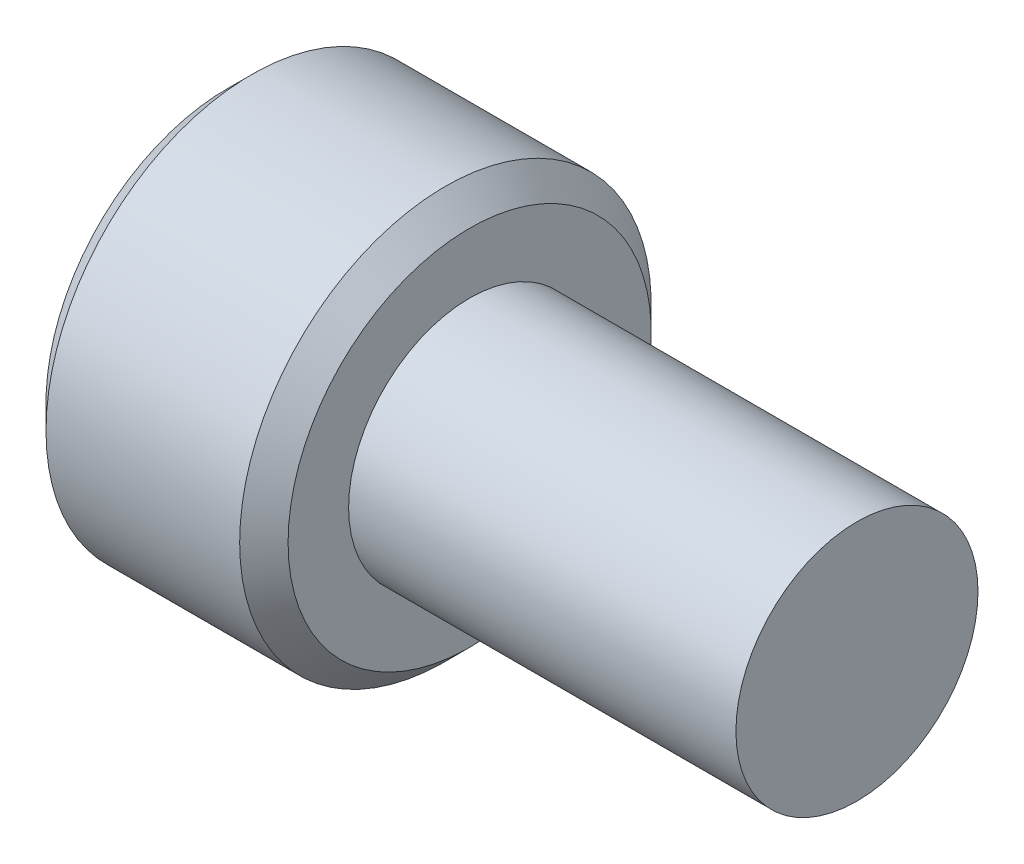
ISO-10303-21;
HEADER;
FILE_DESCRIPTION(('STEP AP214'),'2;1');
FILE_NAME('part.step','',(''),(''),'','','');
FILE_SCHEMA(('AUTOMOTIVE_DESIGN { 1 0 10303 214 1 1 1 1 }'));
ENDSEC;
DATA;
#1=APPLICATION_CONTEXT('core data for automotive mechanical design processes');
#2=APPLICATION_PROTOCOL_DEFINITION('international standard','automotive_design',2000,#1);
#3=PRODUCT_CONTEXT('',#1,'mechanical');
#4=PRODUCT('Part','Part','',(#3));
#5=PRODUCT_RELATED_PRODUCT_CATEGORY('part','',(#4));
#6=PRODUCT_DEFINITION_FORMATION('','',#4);
#7=PRODUCT_DEFINITION_CONTEXT('part definition',#1,'design');
#8=PRODUCT_DEFINITION('design','',#6,#7);
#9=PRODUCT_DEFINITION_SHAPE('','',#8);
#10=(LENGTH_UNIT() NAMED_UNIT(*) SI_UNIT(.MILLI.,.METRE.));
#11=(NAMED_UNIT(*) PLANE_ANGLE_UNIT() SI_UNIT($,.RADIAN.));
#12=(NAMED_UNIT(*) SI_UNIT($,.STERADIAN.) SOLID_ANGLE_UNIT());
#13=UNCERTAINTY_MEASURE_WITH_UNIT(LENGTH_MEASURE(1.E-05),#10,'distance_accuracy_value','');
#14=(GEOMETRIC_REPRESENTATION_CONTEXT(3) GLOBAL_UNCERTAINTY_ASSIGNED_CONTEXT((#13)) GLOBAL_UNIT_ASSIGNED_CONTEXT((#10,
#11,#12)) REPRESENTATION_CONTEXT('',''));
#15=CARTESIAN_POINT('',(0.,0.,0.));
#16=DIRECTION('',(0.,0.,1.));
#17=DIRECTION('',(1.,0.,0.));
#18=AXIS2_PLACEMENT_3D('',#15,#16,#17);
#19=CARTESIAN_POINT('',(-5.,0.,0.));
#20=DIRECTION('',(1.,0.,0.));
#21=DIRECTION('',(0.,0.,-1.));
#22=AXIS2_PLACEMENT_3D('',#19,#20,#21);
#23=PLANE('',#22);
#24=CARTESIAN_POINT('',(-5.,0.,0.));
#25=DIRECTION('',(1.,0.,0.));
#26=DIRECTION('',(0.,0.,-1.));
#27=AXIS2_PLACEMENT_3D('',#24,#25,#26);
#28=CIRCLE('',#27,3.75);
#29=CARTESIAN_POINT('',(-5.,0.,-3.75));
#30=VERTEX_POINT('',#29);
#31=EDGE_CURVE('E11',#30,#30,#28,.F.);
#32=ORIENTED_EDGE('',*,*,#31,.T.);
#33=EDGE_LOOP('',(#32));
#34=FACE_BOUND('',#33,.T.);
#35=DIRECTION('',(0.,0.5,-0.866025403784438));
#36=VECTOR('',#35,1.);
#37=CARTESIAN_POINT('',(-5.,1.15470053837925,2.));
#38=LINE('',#37,#36);
#39=CARTESIAN_POINT('',(-5.,1.15470053837925,2.));
#40=VERTEX_POINT('',#39);
#41=CARTESIAN_POINT('',(-5.,2.3094010767585,0.));
#42=VERTEX_POINT('',#41);
#43=EDGE_CURVE('E151',#40,#42,#38,.T.);
#44=ORIENTED_EDGE('',*,*,#43,.F.);
#45=DIRECTION('',(0.,1.,0.));
#46=VECTOR('',#45,1.);
#47=CARTESIAN_POINT('',(-5.,-1.15470053837925,2.));
#48=LINE('',#47,#46);
#49=CARTESIAN_POINT('',(-5.,-1.15470053837925,2.));
#50=VERTEX_POINT('',#49);
#51=EDGE_CURVE('E124',#50,#40,#48,.T.);
#52=ORIENTED_EDGE('',*,*,#51,.F.);
#53=DIRECTION('',(0.,0.5,0.866025403784439));
#54=VECTOR('',#53,1.);
#55=CARTESIAN_POINT('',(-5.,-2.3094010767585,0.));
#56=LINE('',#55,#54);
#57=CARTESIAN_POINT('',(-5.,-2.3094010767585,0.));
#58=VERTEX_POINT('',#57);
#59=EDGE_CURVE('E120',#58,#50,#56,.T.);
#60=ORIENTED_EDGE('',*,*,#59,.F.);
#61=DIRECTION('',(0.,-0.5,0.866025403784439));
#62=VECTOR('',#61,1.);
#63=CARTESIAN_POINT('',(-5.,-1.15470053837925,-2.));
#64=LINE('',#63,#62);
#65=CARTESIAN_POINT('',(-5.,-1.15470053837925,-2.));
#66=VERTEX_POINT('',#65);
#67=EDGE_CURVE('E157',#66,#58,#64,.T.);
#68=ORIENTED_EDGE('',*,*,#67,.F.);
#69=DIRECTION('',(0.,-1.,0.));
#70=VECTOR('',#69,1.);
#71=CARTESIAN_POINT('',(-5.,1.15470053837925,-2.));
#72=LINE('',#71,#70);
#73=CARTESIAN_POINT('',(-5.,1.15470053837925,-2.));
#74=VERTEX_POINT('',#73);
#75=EDGE_CURVE('E155',#74,#66,#72,.T.);
#76=ORIENTED_EDGE('',*,*,#75,.F.);
#77=DIRECTION('',(0.,-0.5,-0.866025403784439));
#78=VECTOR('',#77,1.);
#79=CARTESIAN_POINT('',(-5.,2.3094010767585,0.));
#80=LINE('',#79,#78);
#81=EDGE_CURVE('E153',#42,#74,#80,.T.);
#82=ORIENTED_EDGE('',*,*,#81,.F.);
#83=EDGE_LOOP('',(#44,#52,#60,#68,#76,#82));
#84=FACE_BOUND('',#83,.T.);
#85=ADVANCED_FACE('F38',(#34,#84),#23,.F.);
#86=CARTESIAN_POINT('',(0.,2.5,0.));
#87=DIRECTION('',(-1.,0.,0.));
#88=DIRECTION('',(0.,0.,1.));
#89=AXIS2_PLACEMENT_3D('',#86,#87,#88);
#90=PLANE('',#89);
#91=CARTESIAN_POINT('',(0.,0.,0.));
#92=DIRECTION('',(-1.,0.,0.));
#93=DIRECTION('',(0.,0.,1.));
#94=AXIS2_PLACEMENT_3D('',#91,#92,#93);
#95=CIRCLE('',#94,3.75);
#96=CARTESIAN_POINT('',(0.,0.,3.75));
#97=VERTEX_POINT('',#96);
#98=EDGE_CURVE('E46',#97,#97,#95,.F.);
#99=ORIENTED_EDGE('',*,*,#98,.T.);
#100=EDGE_LOOP('',(#99));
#101=FACE_BOUND('',#100,.T.);
#102=CARTESIAN_POINT('',(0.,0.,0.));
#103=DIRECTION('',(-1.,0.,0.));
#104=DIRECTION('',(0.,0.,1.));
#105=AXIS2_PLACEMENT_3D('',#102,#103,#104);
#106=CIRCLE('',#105,2.5);
#107=CARTESIAN_POINT('',(0.,0.,2.5));
#108=VERTEX_POINT('',#107);
#109=EDGE_CURVE('E176',#108,#108,#106,.T.);
#110=ORIENTED_EDGE('',*,*,#109,.T.);
#111=EDGE_LOOP('',(#110));
#112=FACE_BOUND('',#111,.T.);
#113=ADVANCED_FACE('F191',(#101,#112),#90,.F.);
#114=CARTESIAN_POINT('',(-10.4,0.,0.));
#115=DIRECTION('',(-1.,0.,0.));
#116=DIRECTION('',(0.,0.,1.));
#117=AXIS2_PLACEMENT_3D('',#114,#115,#116);
#118=CYLINDRICAL_SURFACE('',#117,4.25);
#119=CARTESIAN_POINT('',(-0.5,0.,0.));
#120=DIRECTION('',(-1.,0.,0.));
#121=DIRECTION('',(0.,0.,1.));
#122=AXIS2_PLACEMENT_3D('',#119,#120,#121);
#123=CIRCLE('',#122,4.25);
#124=CARTESIAN_POINT('',(-0.5,0.,4.25));
#125=VERTEX_POINT('',#124);
#126=EDGE_CURVE('E186',#125,#125,#123,.T.);
#127=ORIENTED_EDGE('',*,*,#126,.T.);
#128=EDGE_LOOP('',(#127));
#129=FACE_BOUND('',#128,.T.);
#130=CARTESIAN_POINT('',(-4.5,0.,0.));
#131=DIRECTION('',(1.,0.,0.));
#132=DIRECTION('',(0.,0.,-1.));
#133=AXIS2_PLACEMENT_3D('',#130,#131,#132);
#134=CIRCLE('',#133,4.25);
#135=CARTESIAN_POINT('',(-4.5,0.,-4.25));
#136=VERTEX_POINT('',#135);
#137=EDGE_CURVE('E183',#136,#136,#134,.T.);
#138=ORIENTED_EDGE('',*,*,#137,.T.);
#139=EDGE_LOOP('',(#138));
#140=FACE_BOUND('',#139,.T.);
#141=ADVANCED_FACE('F200',(#129,#140),#118,.T.);
#142=CARTESIAN_POINT('',(8.,2.5,0.));
#143=DIRECTION('',(-1.,0.,0.));
#144=DIRECTION('',(0.,0.,1.));
#145=AXIS2_PLACEMENT_3D('',#142,#143,#144);
#146=PLANE('',#145);
#147=CARTESIAN_POINT('',(8.,0.,0.));
#148=DIRECTION('',(-1.,0.,0.));
#149=DIRECTION('',(0.,0.,1.));
#150=AXIS2_PLACEMENT_3D('',#147,#148,#149);
#151=CIRCLE('',#150,2.5);
#152=CARTESIAN_POINT('',(8.,0.,2.5));
#153=VERTEX_POINT('',#152);
#154=EDGE_CURVE('E180',#153,#153,#151,.T.);
#155=ORIENTED_EDGE('',*,*,#154,.F.);
#156=EDGE_LOOP('',(#155));
#157=FACE_BOUND('',#156,.T.);
#158=ADVANCED_FACE('F203',(#157),#146,.F.);
#159=CARTESIAN_POINT('',(-10.4,0.,0.));
#160=DIRECTION('',(-1.,0.,0.));
#161=DIRECTION('',(0.,0.,1.));
#162=AXIS2_PLACEMENT_3D('',#159,#160,#161);
#163=CYLINDRICAL_SURFACE('',#162,2.5);
#164=ORIENTED_EDGE('',*,*,#109,.F.);
#165=EDGE_LOOP('',(#164));
#166=FACE_BOUND('',#165,.T.);
#167=ORIENTED_EDGE('',*,*,#154,.T.);
#168=EDGE_LOOP('',(#167));
#169=FACE_BOUND('',#168,.T.);
#170=ADVANCED_FACE('F276',(#166,#169),#163,.T.);
#171=CARTESIAN_POINT('',(-3.,-1.15470053837925,2.));
#172=DIRECTION('',(0.,0.,1.));
#173=DIRECTION('',(1.,0.,0.));
#174=AXIS2_PLACEMENT_3D('',#171,#172,#173);
#175=PLANE('',#174);
#176=DIRECTION('',(0.,1.,0.));
#177=VECTOR('',#176,1.);
#178=CARTESIAN_POINT('',(-3.,-1.15470053837925,2.));
#179=LINE('',#178,#177);
#180=CARTESIAN_POINT('',(-3.,-1.15470053837925,2.));
#181=VERTEX_POINT('',#180);
#182=CARTESIAN_POINT('',(-3.,0.,2.));
#183=VERTEX_POINT('',#182);
#184=EDGE_CURVE('E61',#181,#183,#179,.T.);
#185=ORIENTED_EDGE('',*,*,#184,.F.);
#186=DIRECTION('',(-1.,0.,0.));
#187=VECTOR('',#186,1.);
#188=CARTESIAN_POINT('',(-3.,-1.15470053837925,2.));
#189=LINE('',#188,#187);
#190=EDGE_CURVE('E161',#181,#50,#189,.T.);
#191=ORIENTED_EDGE('',*,*,#190,.T.);
#192=ORIENTED_EDGE('',*,*,#51,.T.);
#193=DIRECTION('',(-1.,0.,0.));
#194=VECTOR('',#193,1.);
#195=CARTESIAN_POINT('',(-3.,1.15470053837925,2.));
#196=LINE('',#195,#194);
#197=CARTESIAN_POINT('',(-3.,1.15470053837925,2.));
#198=VERTEX_POINT('',#197);
#199=EDGE_CURVE('E53',#198,#40,#196,.T.);
#200=ORIENTED_EDGE('',*,*,#199,.F.);
#201=EDGE_CURVE('E113',#183,#198,#179,.T.);
#202=ORIENTED_EDGE('',*,*,#201,.F.);
#203=EDGE_LOOP('',(#185,#191,#192,#200,#202));
#204=FACE_BOUND('',#203,.T.);
#205=ADVANCED_FACE('F122',(#204),#175,.F.);
#206=CARTESIAN_POINT('',(-3.,-2.3094010767585,0.));
#207=DIRECTION('',(0.,-0.866025403784439,0.5));
#208=DIRECTION('',(0.,-0.5,-0.866025403784439));
#209=AXIS2_PLACEMENT_3D('',#206,#207,#208);
#210=PLANE('',#209);
#211=DIRECTION('',(0.,0.5,0.866025403784439));
#212=VECTOR('',#211,1.);
#213=CARTESIAN_POINT('',(-3.,-2.3094010767585,0.));
#214=LINE('',#213,#212);
#215=CARTESIAN_POINT('',(-3.,-2.3094010767585,0.));
#216=VERTEX_POINT('',#215);
#217=CARTESIAN_POINT('',(-3.,-1.73205080756888,1.));
#218=VERTEX_POINT('',#217);
#219=EDGE_CURVE('E127',#216,#218,#214,.T.);
#220=ORIENTED_EDGE('',*,*,#219,.F.);
#221=DIRECTION('',(-1.,0.,0.));
#222=VECTOR('',#221,1.);
#223=CARTESIAN_POINT('',(-3.,-2.3094010767585,0.));
#224=LINE('',#223,#222);
#225=EDGE_CURVE('E164',#216,#58,#224,.T.);
#226=ORIENTED_EDGE('',*,*,#225,.T.);
#227=ORIENTED_EDGE('',*,*,#59,.T.);
#228=ORIENTED_EDGE('',*,*,#190,.F.);
#229=EDGE_CURVE('E147',#218,#181,#214,.T.);
#230=ORIENTED_EDGE('',*,*,#229,.F.);
#231=EDGE_LOOP('',(#220,#226,#227,#228,#230));
#232=FACE_BOUND('',#231,.T.);
#233=ADVANCED_FACE('F238',(#232),#210,.F.);
#234=CARTESIAN_POINT('',(-3.,-1.15470053837925,-2.));
#235=DIRECTION('',(0.,-0.866025403784439,-0.5));
#236=DIRECTION('',(0.,0.5,-0.866025403784439));
#237=AXIS2_PLACEMENT_3D('',#234,#235,#236);
#238=PLANE('',#237);
#239=DIRECTION('',(0.,-0.5,0.866025403784439));
#240=VECTOR('',#239,1.);
#241=CARTESIAN_POINT('',(-3.,-1.15470053837925,-2.));
#242=LINE('',#241,#240);
#243=CARTESIAN_POINT('',(-3.,-1.15470053837925,-2.));
#244=VERTEX_POINT('',#243);
#245=CARTESIAN_POINT('',(-3.,-1.73205080756888,-1.));
#246=VERTEX_POINT('',#245);
#247=EDGE_CURVE('E144',#244,#246,#242,.T.);
#248=ORIENTED_EDGE('',*,*,#247,.F.);
#249=DIRECTION('',(-1.,0.,0.));
#250=VECTOR('',#249,1.);
#251=CARTESIAN_POINT('',(-3.,-1.15470053837925,-2.));
#252=LINE('',#251,#250);
#253=EDGE_CURVE('E167',#244,#66,#252,.T.);
#254=ORIENTED_EDGE('',*,*,#253,.T.);
#255=ORIENTED_EDGE('',*,*,#67,.T.);
#256=ORIENTED_EDGE('',*,*,#225,.F.);
#257=EDGE_CURVE('E143',#246,#216,#242,.T.);
#258=ORIENTED_EDGE('',*,*,#257,.F.);
#259=EDGE_LOOP('',(#248,#254,#255,#256,#258));
#260=FACE_BOUND('',#259,.T.);
#261=ADVANCED_FACE('F245',(#260),#238,.F.);
#262=CARTESIAN_POINT('',(-3.,1.15470053837925,-2.));
#263=DIRECTION('',(0.,0.,-1.));
#264=DIRECTION('',(0.,1.,0.));
#265=AXIS2_PLACEMENT_3D('',#262,#263,#264);
#266=PLANE('',#265);
#267=DIRECTION('',(0.,-1.,0.));
#268=VECTOR('',#267,1.);
#269=CARTESIAN_POINT('',(-3.,1.15470053837925,-2.));
#270=LINE('',#269,#268);
#271=CARTESIAN_POINT('',(-3.,1.15470053837925,-2.));
#272=VERTEX_POINT('',#271);
#273=CARTESIAN_POINT('',(-3.,0.,-2.));
#274=VERTEX_POINT('',#273);
#275=EDGE_CURVE('E140',#272,#274,#270,.T.);
#276=ORIENTED_EDGE('',*,*,#275,.F.);
#277=DIRECTION('',(-1.,0.,0.));
#278=VECTOR('',#277,1.);
#279=CARTESIAN_POINT('',(-3.,1.15470053837925,-2.));
#280=LINE('',#279,#278);
#281=EDGE_CURVE('E170',#272,#74,#280,.T.);
#282=ORIENTED_EDGE('',*,*,#281,.T.);
#283=ORIENTED_EDGE('',*,*,#75,.T.);
#284=ORIENTED_EDGE('',*,*,#253,.F.);
#285=EDGE_CURVE('E139',#274,#244,#270,.T.);
#286=ORIENTED_EDGE('',*,*,#285,.F.);
#287=EDGE_LOOP('',(#276,#282,#283,#284,#286));
#288=FACE_BOUND('',#287,.T.);
#289=ADVANCED_FACE('F250',(#288),#266,.F.);
#290=CARTESIAN_POINT('',(-3.,2.3094010767585,0.));
#291=DIRECTION('',(0.,0.866025403784439,-0.5));
#292=DIRECTION('',(0.,0.5,0.866025403784439));
#293=AXIS2_PLACEMENT_3D('',#290,#291,#292);
#294=PLANE('',#293);
#295=DIRECTION('',(0.,-0.5,-0.866025403784439));
#296=VECTOR('',#295,1.);
#297=CARTESIAN_POINT('',(-3.,2.3094010767585,0.));
#298=LINE('',#297,#296);
#299=CARTESIAN_POINT('',(-3.,2.3094010767585,0.));
#300=VERTEX_POINT('',#299);
#301=CARTESIAN_POINT('',(-3.,1.73205080756888,-1.));
#302=VERTEX_POINT('',#301);
#303=EDGE_CURVE('E135',#300,#302,#298,.T.);
#304=ORIENTED_EDGE('',*,*,#303,.F.);
#305=DIRECTION('',(-1.,0.,0.));
#306=VECTOR('',#305,1.);
#307=CARTESIAN_POINT('',(-3.,2.3094010767585,0.));
#308=LINE('',#307,#306);
#309=EDGE_CURVE('E126',#300,#42,#308,.T.);
#310=ORIENTED_EDGE('',*,*,#309,.T.);
#311=ORIENTED_EDGE('',*,*,#81,.T.);
#312=ORIENTED_EDGE('',*,*,#281,.F.);
#313=EDGE_CURVE('E133',#302,#272,#298,.T.);
#314=ORIENTED_EDGE('',*,*,#313,.F.);
#315=EDGE_LOOP('',(#304,#310,#311,#312,#314));
#316=FACE_BOUND('',#315,.T.);
#317=ADVANCED_FACE('F219',(#316),#294,.F.);
#318=CARTESIAN_POINT('',(-3.,1.15470053837925,2.));
#319=DIRECTION('',(0.,0.866025403784439,0.5));
#320=DIRECTION('',(0.,-0.5,0.866025403784439));
#321=AXIS2_PLACEMENT_3D('',#318,#319,#320);
#322=PLANE('',#321);
#323=DIRECTION('',(0.,0.5,-0.866025403784438));
#324=VECTOR('',#323,1.);
#325=CARTESIAN_POINT('',(-3.,1.15470053837925,2.));
#326=LINE('',#325,#324);
#327=CARTESIAN_POINT('',(-3.,1.73205080756888,1.));
#328=VERTEX_POINT('',#327);
#329=EDGE_CURVE('E115',#198,#328,#326,.T.);
#330=ORIENTED_EDGE('',*,*,#329,.F.);
#331=ORIENTED_EDGE('',*,*,#199,.T.);
#332=ORIENTED_EDGE('',*,*,#43,.T.);
#333=ORIENTED_EDGE('',*,*,#309,.F.);
#334=EDGE_CURVE('E132',#328,#300,#326,.T.);
#335=ORIENTED_EDGE('',*,*,#334,.F.);
#336=EDGE_LOOP('',(#330,#331,#332,#333,#335));
#337=FACE_BOUND('',#336,.T.);
#338=ADVANCED_FACE('F130',(#337),#322,.F.);
#339=CARTESIAN_POINT('',(-3.,0.,0.));
#340=DIRECTION('',(-1.,0.,0.));
#341=DIRECTION('',(0.,0.,1.));
#342=AXIS2_PLACEMENT_3D('',#339,#340,#341);
#343=PLANE('',#342);
#344=ORIENTED_EDGE('',*,*,#201,.T.);
#345=ORIENTED_EDGE('',*,*,#329,.T.);
#346=CARTESIAN_POINT('',(-3.,0.,0.));
#347=DIRECTION('',(-1.,0.,0.));
#348=DIRECTION('',(0.,0.,1.));
#349=AXIS2_PLACEMENT_3D('',#346,#347,#348);
#350=CIRCLE('',#349,2.);
#351=EDGE_CURVE('E117',#183,#328,#350,.T.);
#352=ORIENTED_EDGE('',*,*,#351,.F.);
#353=EDGE_LOOP('',(#344,#345,#352));
#354=FACE_BOUND('',#353,.T.);
#355=ADVANCED_FACE('F114',(#354),#343,.T.);
#356=ORIENTED_EDGE('',*,*,#334,.T.);
#357=ORIENTED_EDGE('',*,*,#303,.T.);
#358=EDGE_CURVE('E177',#328,#302,#350,.T.);
#359=ORIENTED_EDGE('',*,*,#358,.F.);
#360=EDGE_LOOP('',(#356,#357,#359));
#361=FACE_BOUND('',#360,.T.);
#362=ADVANCED_FACE('F224',(#361),#343,.T.);
#363=ORIENTED_EDGE('',*,*,#313,.T.);
#364=ORIENTED_EDGE('',*,*,#275,.T.);
#365=EDGE_CURVE('E229',#302,#274,#350,.T.);
#366=ORIENTED_EDGE('',*,*,#365,.F.);
#367=EDGE_LOOP('',(#363,#364,#366));
#368=FACE_BOUND('',#367,.T.);
#369=ADVANCED_FACE('F255',(#368),#343,.T.);
#370=ORIENTED_EDGE('',*,*,#285,.T.);
#371=ORIENTED_EDGE('',*,*,#247,.T.);
#372=EDGE_CURVE('E230',#274,#246,#350,.T.);
#373=ORIENTED_EDGE('',*,*,#372,.F.);
#374=EDGE_LOOP('',(#370,#371,#373));
#375=FACE_BOUND('',#374,.T.);
#376=ADVANCED_FACE('F253',(#375),#343,.T.);
#377=ORIENTED_EDGE('',*,*,#257,.T.);
#378=ORIENTED_EDGE('',*,*,#219,.T.);
#379=EDGE_CURVE('E231',#246,#218,#350,.T.);
#380=ORIENTED_EDGE('',*,*,#379,.F.);
#381=EDGE_LOOP('',(#377,#378,#380));
#382=FACE_BOUND('',#381,.T.);
#383=ADVANCED_FACE('F240',(#382),#343,.T.);
#384=ORIENTED_EDGE('',*,*,#229,.T.);
#385=ORIENTED_EDGE('',*,*,#184,.T.);
#386=EDGE_CURVE('E163',#218,#183,#350,.T.);
#387=ORIENTED_EDGE('',*,*,#386,.F.);
#388=EDGE_LOOP('',(#384,#385,#387));
#389=FACE_BOUND('',#388,.T.);
#390=ADVANCED_FACE('F234',(#389),#343,.T.);
#391=CARTESIAN_POINT('',(-1.79827876194487,0.,0.));
#392=DIRECTION('',(-1.,0.,0.));
#393=DIRECTION('',(0.,0.,1.));
#394=AXIS2_PLACEMENT_3D('',#391,#392,#393);
#395=CONICAL_SURFACE('',#394,0.,1.02974425867665);
#396=ORIENTED_EDGE('',*,*,#351,.T.);
#397=ORIENTED_EDGE('',*,*,#358,.T.);
#398=ORIENTED_EDGE('',*,*,#365,.T.);
#399=ORIENTED_EDGE('',*,*,#372,.T.);
#400=ORIENTED_EDGE('',*,*,#379,.T.);
#401=ORIENTED_EDGE('',*,*,#386,.T.);
#402=EDGE_LOOP('',(#396,#397,#398,#399,#400,#401));
#403=FACE_BOUND('',#402,.T.);
#404=CARTESIAN_POINT('',(-1.79827876194487,0.,0.));
#405=VERTEX_POINT('',#404);
#406=VERTEX_LOOP('',#405);
#407=FACE_BOUND('',#406,.T.);
#408=ADVANCED_FACE('F197',(#403,#407),#395,.F.);
#409=CARTESIAN_POINT('',(-0.5,0.,0.));
#410=DIRECTION('',(-1.,0.,0.));
#411=DIRECTION('',(0.,0.,1.));
#412=AXIS2_PLACEMENT_3D('',#409,#410,#411);
#413=CONICAL_SURFACE('',#412,4.25,0.785398163397448);
#414=ORIENTED_EDGE('',*,*,#98,.F.);
#415=EDGE_LOOP('',(#414));
#416=FACE_BOUND('',#415,.T.);
#417=ORIENTED_EDGE('',*,*,#126,.F.);
#418=EDGE_LOOP('',(#417));
#419=FACE_BOUND('',#418,.T.);
#420=ADVANCED_FACE('F194',(#416,#419),#413,.T.);
#421=CARTESIAN_POINT('',(-5.,0.,0.));
#422=DIRECTION('',(1.,0.,0.));
#423=DIRECTION('',(0.,0.,-1.));
#424=AXIS2_PLACEMENT_3D('',#421,#422,#423);
#425=CONICAL_SURFACE('',#424,3.75,0.785398163397447);
#426=ORIENTED_EDGE('',*,*,#137,.F.);
#427=EDGE_LOOP('',(#426));
#428=FACE_BOUND('',#427,.T.);
#429=ORIENTED_EDGE('',*,*,#31,.F.);
#430=EDGE_LOOP('',(#429));
#431=FACE_BOUND('',#430,.T.);
#432=ADVANCED_FACE('F40',(#428,#431),#425,.T.);
#433=CLOSED_SHELL('',(#85,#113,#141,#158,#170,#205,#233,#261,#289,#317,#338,#355,#362,#369,#376,
#383,#390,#408,#420,#432));
#434=MANIFOLD_SOLID_BREP('B2',#433);
#435=ADVANCED_BREP_SHAPE_REPRESENTATION('',(#18,#434),#14);
#436=SHAPE_DEFINITION_REPRESENTATION(#9,#435);
ENDSEC;
END-ISO-10303-21;
